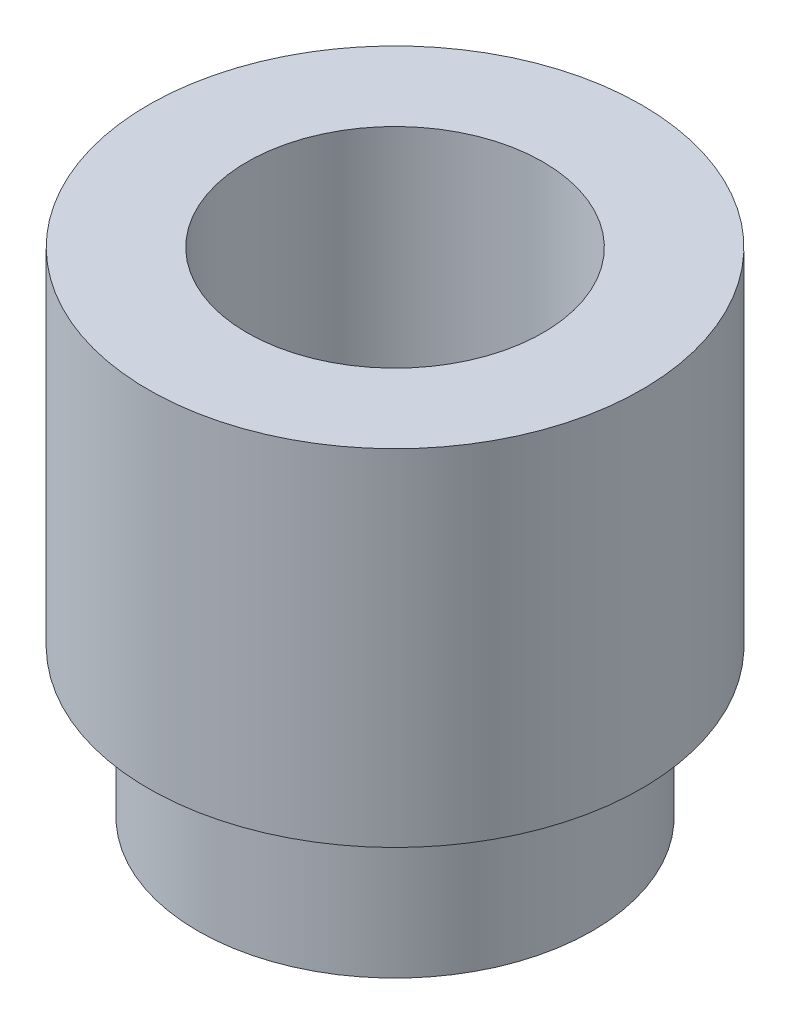
ISO-10303-21;
HEADER;
FILE_DESCRIPTION(('STEP AP214'),'2;1');
FILE_NAME('part.step','',(''),(''),'','','');
FILE_SCHEMA(('AUTOMOTIVE_DESIGN { 1 0 10303 214 1 1 1 1 }'));
ENDSEC;
DATA;
#1=APPLICATION_CONTEXT('core data for automotive mechanical design processes');
#2=APPLICATION_PROTOCOL_DEFINITION('international standard','automotive_design',2000,#1);
#3=PRODUCT_CONTEXT('',#1,'mechanical');
#4=PRODUCT('Part','Part','',(#3));
#5=PRODUCT_RELATED_PRODUCT_CATEGORY('part','',(#4));
#6=PRODUCT_DEFINITION_FORMATION('','',#4);
#7=PRODUCT_DEFINITION_CONTEXT('part definition',#1,'design');
#8=PRODUCT_DEFINITION('design','',#6,#7);
#9=PRODUCT_DEFINITION_SHAPE('','',#8);
#10=(LENGTH_UNIT() NAMED_UNIT(*) SI_UNIT(.MILLI.,.METRE.));
#11=(NAMED_UNIT(*) PLANE_ANGLE_UNIT() SI_UNIT($,.RADIAN.));
#12=(NAMED_UNIT(*) SI_UNIT($,.STERADIAN.) SOLID_ANGLE_UNIT());
#13=UNCERTAINTY_MEASURE_WITH_UNIT(LENGTH_MEASURE(1.E-05),#10,'distance_accuracy_value','');
#14=(GEOMETRIC_REPRESENTATION_CONTEXT(3) GLOBAL_UNCERTAINTY_ASSIGNED_CONTEXT((#13)) GLOBAL_UNIT_ASSIGNED_CONTEXT((#10,
#11,#12)) REPRESENTATION_CONTEXT('',''));
#15=CARTESIAN_POINT('',(0.,0.,0.));
#16=DIRECTION('',(0.,0.,1.));
#17=DIRECTION('',(1.,0.,0.));
#18=AXIS2_PLACEMENT_3D('',#15,#16,#17);
#19=CARTESIAN_POINT('',(0.,0.,-2.));
#20=DIRECTION('',(0.,-1.,0.));
#21=DIRECTION('',(0.,0.,-1.));
#22=AXIS2_PLACEMENT_3D('',#19,#20,#21);
#23=PLANE('',#22);
#24=CARTESIAN_POINT('',(0.,0.,0.));
#25=DIRECTION('',(0.,-1.,0.));
#26=DIRECTION('',(0.,0.,-1.));
#27=AXIS2_PLACEMENT_3D('',#24,#25,#26);
#28=CIRCLE('',#27,2.);
#29=CARTESIAN_POINT('',(0.,0.,-2.));
#30=VERTEX_POINT('',#29);
#31=EDGE_CURVE('E57',#30,#30,#28,.T.);
#32=ORIENTED_EDGE('',*,*,#31,.T.);
#33=EDGE_LOOP('',(#32));
#34=FACE_BOUND('',#33,.T.);
#35=CARTESIAN_POINT('',(0.,0.,0.));
#36=DIRECTION('',(0.,-1.,0.));
#37=DIRECTION('',(0.,0.,-1.));
#38=AXIS2_PLACEMENT_3D('',#35,#36,#37);
#39=CIRCLE('',#38,1.5);
#40=CARTESIAN_POINT('',(0.,0.,-1.5));
#41=VERTEX_POINT('',#40);
#42=EDGE_CURVE('E10',#41,#41,#39,.T.);
#43=ORIENTED_EDGE('',*,*,#42,.F.);
#44=EDGE_LOOP('',(#43));
#45=FACE_BOUND('',#44,.T.);
#46=ADVANCED_FACE('F35',(#34,#45),#23,.T.);
#47=CARTESIAN_POINT('',(0.,0.,0.));
#48=DIRECTION('',(0.,-1.,0.));
#49=DIRECTION('',(0.,0.,-1.));
#50=AXIS2_PLACEMENT_3D('',#47,#48,#49);
#51=CYLINDRICAL_SURFACE('',#50,1.5);
#52=ORIENTED_EDGE('',*,*,#42,.T.);
#53=EDGE_LOOP('',(#52));
#54=FACE_BOUND('',#53,.T.);
#55=CARTESIAN_POINT('',(0.,5.,0.));
#56=DIRECTION('',(0.,-1.,0.));
#57=DIRECTION('',(0.,0.,-1.));
#58=AXIS2_PLACEMENT_3D('',#55,#56,#57);
#59=CIRCLE('',#58,1.5);
#60=CARTESIAN_POINT('',(0.,5.,-1.5));
#61=VERTEX_POINT('',#60);
#62=EDGE_CURVE('E41',#61,#61,#59,.T.);
#63=ORIENTED_EDGE('',*,*,#62,.F.);
#64=EDGE_LOOP('',(#63));
#65=FACE_BOUND('',#64,.T.);
#66=ADVANCED_FACE('F75',(#54,#65),#51,.F.);
#67=CARTESIAN_POINT('',(0.,5.,-1.5));
#68=DIRECTION('',(0.,1.,0.));
#69=DIRECTION('',(0.,0.,1.));
#70=AXIS2_PLACEMENT_3D('',#67,#68,#69);
#71=PLANE('',#70);
#72=ORIENTED_EDGE('',*,*,#62,.T.);
#73=EDGE_LOOP('',(#72));
#74=FACE_BOUND('',#73,.T.);
#75=CARTESIAN_POINT('',(0.,5.,0.));
#76=DIRECTION('',(0.,-1.,0.));
#77=DIRECTION('',(0.,0.,-1.));
#78=AXIS2_PLACEMENT_3D('',#75,#76,#77);
#79=CIRCLE('',#78,2.5);
#80=CARTESIAN_POINT('',(0.,5.,-2.5));
#81=VERTEX_POINT('',#80);
#82=EDGE_CURVE('E45',#81,#81,#79,.T.);
#83=ORIENTED_EDGE('',*,*,#82,.F.);
#84=EDGE_LOOP('',(#83));
#85=FACE_BOUND('',#84,.T.);
#86=ADVANCED_FACE('F79',(#74,#85),#71,.T.);
#87=CARTESIAN_POINT('',(0.,0.,0.));
#88=DIRECTION('',(0.,-1.,0.));
#89=DIRECTION('',(0.,0.,-1.));
#90=AXIS2_PLACEMENT_3D('',#87,#88,#89);
#91=CYLINDRICAL_SURFACE('',#90,2.5);
#92=ORIENTED_EDGE('',*,*,#82,.T.);
#93=EDGE_LOOP('',(#92));
#94=FACE_BOUND('',#93,.T.);
#95=CARTESIAN_POINT('',(0.,1.5,0.));
#96=DIRECTION('',(0.,-1.,0.));
#97=DIRECTION('',(0.,0.,-1.));
#98=AXIS2_PLACEMENT_3D('',#95,#96,#97);
#99=CIRCLE('',#98,2.5);
#100=CARTESIAN_POINT('',(0.,1.5,-2.5));
#101=VERTEX_POINT('',#100);
#102=EDGE_CURVE('E49',#101,#101,#99,.T.);
#103=ORIENTED_EDGE('',*,*,#102,.F.);
#104=EDGE_LOOP('',(#103));
#105=FACE_BOUND('',#104,.T.);
#106=ADVANCED_FACE('F71',(#94,#105),#91,.T.);
#107=CARTESIAN_POINT('',(0.,1.5,-2.5));
#108=DIRECTION('',(0.,-1.,0.));
#109=DIRECTION('',(0.,0.,-1.));
#110=AXIS2_PLACEMENT_3D('',#107,#108,#109);
#111=PLANE('',#110);
#112=ORIENTED_EDGE('',*,*,#102,.T.);
#113=EDGE_LOOP('',(#112));
#114=FACE_BOUND('',#113,.T.);
#115=CARTESIAN_POINT('',(0.,1.5,0.));
#116=DIRECTION('',(0.,-1.,0.));
#117=DIRECTION('',(0.,0.,-1.));
#118=AXIS2_PLACEMENT_3D('',#115,#116,#117);
#119=CIRCLE('',#118,2.);
#120=CARTESIAN_POINT('',(0.,1.5,-2.));
#121=VERTEX_POINT('',#120);
#122=EDGE_CURVE('E54',#121,#121,#119,.T.);
#123=ORIENTED_EDGE('',*,*,#122,.F.);
#124=EDGE_LOOP('',(#123));
#125=FACE_BOUND('',#124,.T.);
#126=ADVANCED_FACE('F65',(#114,#125),#111,.T.);
#127=CARTESIAN_POINT('',(0.,0.,0.));
#128=DIRECTION('',(0.,-1.,0.));
#129=DIRECTION('',(0.,0.,-1.));
#130=AXIS2_PLACEMENT_3D('',#127,#128,#129);
#131=CYLINDRICAL_SURFACE('',#130,2.);
#132=ORIENTED_EDGE('',*,*,#122,.T.);
#133=EDGE_LOOP('',(#132));
#134=FACE_BOUND('',#133,.T.);
#135=ORIENTED_EDGE('',*,*,#31,.F.);
#136=EDGE_LOOP('',(#135));
#137=FACE_BOUND('',#136,.T.);
#138=ADVANCED_FACE('F63',(#134,#137),#131,.T.);
#139=CLOSED_SHELL('',(#46,#66,#86,#106,#126,#138));
#140=MANIFOLD_SOLID_BREP('B2',#139);
#141=ADVANCED_BREP_SHAPE_REPRESENTATION('',(#18,#140),#14);
#142=SHAPE_DEFINITION_REPRESENTATION(#9,#141);
ENDSEC;
END-ISO-10303-21;
